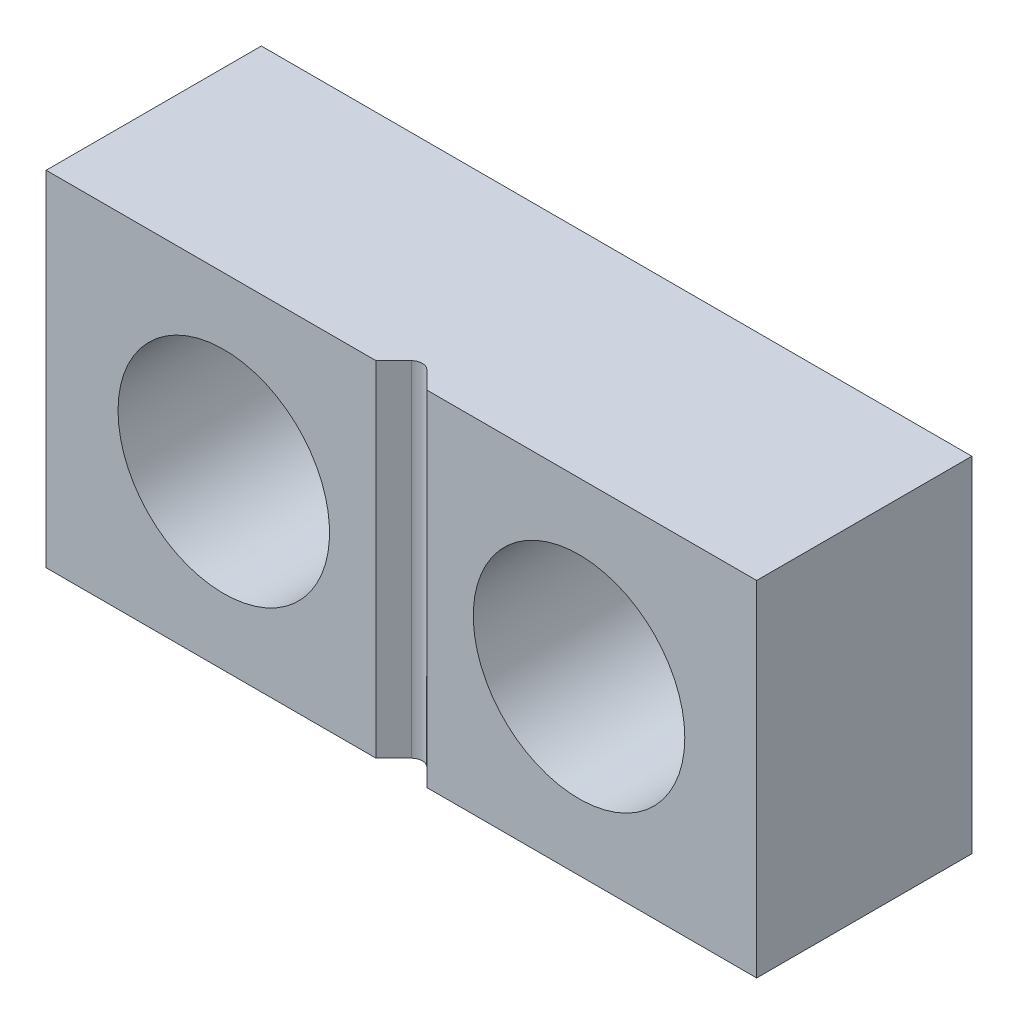
ISO-10303-21;
HEADER;
FILE_DESCRIPTION(('STEP AP214'),'2;1');
FILE_NAME('part.step','',(''),(''),'','','');
FILE_SCHEMA(('AUTOMOTIVE_DESIGN { 1 0 10303 214 1 1 1 1 }'));
ENDSEC;
DATA;
#1=APPLICATION_CONTEXT('core data for automotive mechanical design processes');
#2=APPLICATION_PROTOCOL_DEFINITION('international standard','automotive_design',2000,#1);
#3=PRODUCT_CONTEXT('',#1,'mechanical');
#4=PRODUCT('Part','Part','',(#3));
#5=PRODUCT_RELATED_PRODUCT_CATEGORY('part','',(#4));
#6=PRODUCT_DEFINITION_FORMATION('','',#4);
#7=PRODUCT_DEFINITION_CONTEXT('part definition',#1,'design');
#8=PRODUCT_DEFINITION('design','',#6,#7);
#9=PRODUCT_DEFINITION_SHAPE('','',#8);
#10=(LENGTH_UNIT() NAMED_UNIT(*) SI_UNIT(.MILLI.,.METRE.));
#11=(NAMED_UNIT(*) PLANE_ANGLE_UNIT() SI_UNIT($,.RADIAN.));
#12=(NAMED_UNIT(*) SI_UNIT($,.STERADIAN.) SOLID_ANGLE_UNIT());
#13=UNCERTAINTY_MEASURE_WITH_UNIT(LENGTH_MEASURE(1.E-05),#10,'distance_accuracy_value','');
#14=(GEOMETRIC_REPRESENTATION_CONTEXT(3) GLOBAL_UNCERTAINTY_ASSIGNED_CONTEXT((#13)) GLOBAL_UNIT_ASSIGNED_CONTEXT((#10,
#11,#12)) REPRESENTATION_CONTEXT('',''));
#15=CARTESIAN_POINT('',(0.,0.,0.));
#16=DIRECTION('',(0.,0.,1.));
#17=DIRECTION('',(1.,0.,0.));
#18=AXIS2_PLACEMENT_3D('',#15,#16,#17);
#19=CARTESIAN_POINT('',(8.255,4.,0.));
#20=DIRECTION('',(0.,0.,-0.999999999999999));
#21=DIRECTION('',(-1.,0.,0.));
#22=AXIS2_PLACEMENT_3D('',#19,#20,#21);
#23=PLANE('',#22);
#24=CARTESIAN_POINT('',(-4.12750000000001,0.,0.));
#25=DIRECTION('',(0.,0.,0.999999999999999));
#26=DIRECTION('',(-1.,0.,0.));
#27=AXIS2_PLACEMENT_3D('',#24,#25,#26);
#28=CIRCLE('',#27,2.45745);
#29=CARTESIAN_POINT('',(-6.58495000000001,0.,0.));
#30=VERTEX_POINT('',#29);
#31=EDGE_CURVE('E158',#30,#30,#28,.T.);
#32=ORIENTED_EDGE('',*,*,#31,.F.);
#33=EDGE_LOOP('',(#32));
#34=FACE_BOUND('',#33,.T.);
#35=DIRECTION('',(1.,0.,0.));
#36=VECTOR('',#35,1.);
#37=CARTESIAN_POINT('',(-8.25500000000004,-4.,0.));
#38=LINE('',#37,#36);
#39=CARTESIAN_POINT('',(-8.25500000000004,-4.,0.));
#40=VERTEX_POINT('',#39);
#41=CARTESIAN_POINT('',(-0.590493938389114,-4.,0.));
#42=VERTEX_POINT('',#41);
#43=EDGE_CURVE('E128',#40,#42,#38,.T.);
#44=ORIENTED_EDGE('',*,*,#43,.T.);
#45=DIRECTION('',(0.,1.,0.));
#46=VECTOR('',#45,1.);
#47=CARTESIAN_POINT('',(-0.590493938389114,-4.,0.));
#48=LINE('',#47,#46);
#49=CARTESIAN_POINT('',(-0.590493938389114,3.99999999999999,0.));
#50=VERTEX_POINT('',#49);
#51=EDGE_CURVE('E154',#42,#50,#48,.T.);
#52=ORIENTED_EDGE('',*,*,#51,.T.);
#53=DIRECTION('',(-1.,0.,0.));
#54=VECTOR('',#53,1.);
#55=CARTESIAN_POINT('',(-8.25500000000007,4.,0.));
#56=LINE('',#55,#54);
#57=CARTESIAN_POINT('',(-8.25500000000007,4.,0.));
#58=VERTEX_POINT('',#57);
#59=EDGE_CURVE('E119',#50,#58,#56,.T.);
#60=ORIENTED_EDGE('',*,*,#59,.T.);
#61=DIRECTION('',(0.,-1.,0.));
#62=VECTOR('',#61,1.);
#63=CARTESIAN_POINT('',(-8.25500000000007,4.,0.));
#64=LINE('',#63,#62);
#65=EDGE_CURVE('E118',#58,#40,#64,.T.);
#66=ORIENTED_EDGE('',*,*,#65,.T.);
#67=EDGE_LOOP('',(#44,#52,#60,#66));
#68=FACE_BOUND('',#67,.T.);
#69=ADVANCED_FACE('F34',(#34,#68),#23,.F.);
#70=CARTESIAN_POINT('',(-8.25500000000009,4.00000000000003,-4.99999999999999));
#71=DIRECTION('',(0.,1.,0.));
#72=DIRECTION('',(0.,0.,0.999999999999999));
#73=AXIS2_PLACEMENT_3D('',#70,#71,#72);
#74=PLANE('',#73);
#75=DIRECTION('',(-0.707106781186547,0.,0.707106781186547));
#76=VECTOR('',#75,1.);
#77=CARTESIAN_POINT('',(-0.590493938389114,3.99999999999999,0.));
#78=LINE('',#77,#76);
#79=CARTESIAN_POINT('',(-0.179605122421433,4.,-0.41088881596766));
#80=VERTEX_POINT('',#79);
#81=EDGE_CURVE('E256',#80,#50,#78,.T.);
#82=ORIENTED_EDGE('',*,*,#81,.F.);
#83=CARTESIAN_POINT('',(0.,4.,-0.231283693546277));
#84=DIRECTION('',(0.,1.,0.));
#85=DIRECTION('',(0.,0.,-0.999999999999999));
#86=AXIS2_PLACEMENT_3D('',#83,#84,#85);
#87=CIRCLE('',#86,0.254);
#88=CARTESIAN_POINT('',(0.179605122421378,3.99999999999999,-0.41088881596766));
#89=VERTEX_POINT('',#88);
#90=EDGE_CURVE('E113',#89,#80,#87,.T.);
#91=ORIENTED_EDGE('',*,*,#90,.F.);
#92=DIRECTION('',(-0.707106781186549,0.,-0.707106781186546));
#93=VECTOR('',#92,1.);
#94=CARTESIAN_POINT('',(0.179605122421378,3.99999999999999,-0.41088881596766));
#95=LINE('',#94,#93);
#96=CARTESIAN_POINT('',(0.590493938388989,3.99999999999999,0.));
#97=VERTEX_POINT('',#96);
#98=EDGE_CURVE('E101',#97,#89,#95,.T.);
#99=ORIENTED_EDGE('',*,*,#98,.F.);
#100=CARTESIAN_POINT('',(8.255,4.,0.));
#101=VERTEX_POINT('',#100);
#102=EDGE_CURVE('E110',#101,#97,#56,.T.);
#103=ORIENTED_EDGE('',*,*,#102,.F.);
#104=DIRECTION('',(0.,0.,0.999999999999999));
#105=VECTOR('',#104,1.);
#106=CARTESIAN_POINT('',(8.255,4.00000000000002,-4.99999999999999));
#107=LINE('',#106,#105);
#108=CARTESIAN_POINT('',(8.255,4.00000000000002,-4.99999999999999));
#109=VERTEX_POINT('',#108);
#110=EDGE_CURVE('E11',#109,#101,#107,.T.);
#111=ORIENTED_EDGE('',*,*,#110,.F.);
#112=DIRECTION('',(-1.,0.,0.));
#113=VECTOR('',#112,1.);
#114=CARTESIAN_POINT('',(-8.25500000000009,4.00000000000003,-4.99999999999999));
#115=LINE('',#114,#113);
#116=CARTESIAN_POINT('',(-8.25500000000009,4.00000000000003,-4.99999999999999));
#117=VERTEX_POINT('',#116);
#118=EDGE_CURVE('E132',#109,#117,#115,.T.);
#119=ORIENTED_EDGE('',*,*,#118,.T.);
#120=DIRECTION('',(0.,0.,0.999999999999999));
#121=VECTOR('',#120,1.);
#122=CARTESIAN_POINT('',(-8.25500000000009,4.00000000000003,-4.99999999999999));
#123=LINE('',#122,#121);
#124=EDGE_CURVE('E38',#117,#58,#123,.T.);
#125=ORIENTED_EDGE('',*,*,#124,.T.);
#126=ORIENTED_EDGE('',*,*,#59,.F.);
#127=EDGE_LOOP('',(#82,#91,#99,#103,#111,#119,#125,#126));
#128=FACE_BOUND('',#127,.T.);
#129=ADVANCED_FACE('F36',(#128),#74,.T.);
#130=CARTESIAN_POINT('',(8.255,4.00000000000002,-4.99999999999999));
#131=DIRECTION('',(1.,0.,0.));
#132=DIRECTION('',(0.,0.,-0.999999999999999));
#133=AXIS2_PLACEMENT_3D('',#130,#131,#132);
#134=PLANE('',#133);
#135=DIRECTION('',(0.,1.,0.));
#136=VECTOR('',#135,1.);
#137=CARTESIAN_POINT('',(8.255,4.,0.));
#138=LINE('',#137,#136);
#139=CARTESIAN_POINT('',(8.25499999999994,-4.00000000000002,0.));
#140=VERTEX_POINT('',#139);
#141=EDGE_CURVE('E117',#140,#101,#138,.T.);
#142=ORIENTED_EDGE('',*,*,#141,.F.);
#143=DIRECTION('',(0.,0.,0.999999999999999));
#144=VECTOR('',#143,1.);
#145=CARTESIAN_POINT('',(8.255,-4.,-4.99999999999999));
#146=LINE('',#145,#144);
#147=CARTESIAN_POINT('',(8.255,-4.,-4.99999999999999));
#148=VERTEX_POINT('',#147);
#149=EDGE_CURVE('E43',#148,#140,#146,.T.);
#150=ORIENTED_EDGE('',*,*,#149,.F.);
#151=DIRECTION('',(0.,1.,0.));
#152=VECTOR('',#151,1.);
#153=CARTESIAN_POINT('',(8.255,4.00000000000002,-4.99999999999999));
#154=LINE('',#153,#152);
#155=EDGE_CURVE('E140',#148,#109,#154,.T.);
#156=ORIENTED_EDGE('',*,*,#155,.T.);
#157=ORIENTED_EDGE('',*,*,#110,.T.);
#158=EDGE_LOOP('',(#142,#150,#156,#157));
#159=FACE_BOUND('',#158,.T.);
#160=ADVANCED_FACE('F198',(#159),#134,.T.);
#161=CARTESIAN_POINT('',(-8.25500000000004,-4.,-4.99999999999999));
#162=DIRECTION('',(0.,-1.,0.));
#163=DIRECTION('',(0.,0.,-0.999999999999999));
#164=AXIS2_PLACEMENT_3D('',#161,#162,#163);
#165=PLANE('',#164);
#166=DIRECTION('',(-0.707106781186547,0.,0.707106781186547));
#167=VECTOR('',#166,1.);
#168=CARTESIAN_POINT('',(-0.590493938389114,-4.,0.));
#169=LINE('',#168,#167);
#170=CARTESIAN_POINT('',(-0.179605122421433,-3.99999999999999,-0.41088881596766));
#171=VERTEX_POINT('',#170);
#172=EDGE_CURVE('E107',#171,#42,#169,.T.);
#173=ORIENTED_EDGE('',*,*,#172,.T.);
#174=ORIENTED_EDGE('',*,*,#43,.F.);
#175=DIRECTION('',(0.,0.,0.999999999999999));
#176=VECTOR('',#175,1.);
#177=CARTESIAN_POINT('',(-8.25500000000004,-4.,-4.99999999999999));
#178=LINE('',#177,#176);
#179=CARTESIAN_POINT('',(-8.25500000000004,-4.,-4.99999999999999));
#180=VERTEX_POINT('',#179);
#181=EDGE_CURVE('E144',#180,#40,#178,.T.);
#182=ORIENTED_EDGE('',*,*,#181,.F.);
#183=DIRECTION('',(1.,0.,0.));
#184=VECTOR('',#183,1.);
#185=CARTESIAN_POINT('',(-8.25500000000004,-4.,-4.99999999999999));
#186=LINE('',#185,#184);
#187=EDGE_CURVE('E137',#180,#148,#186,.T.);
#188=ORIENTED_EDGE('',*,*,#187,.T.);
#189=ORIENTED_EDGE('',*,*,#149,.T.);
#190=CARTESIAN_POINT('',(0.590493938389003,-4.,0.));
#191=VERTEX_POINT('',#190);
#192=EDGE_CURVE('E122',#191,#140,#38,.T.);
#193=ORIENTED_EDGE('',*,*,#192,.F.);
#194=DIRECTION('',(-0.707106781186549,0.,-0.707106781186546));
#195=VECTOR('',#194,1.);
#196=CARTESIAN_POINT('',(0.179605122421336,-3.99999999999999,-0.41088881596766));
#197=LINE('',#196,#195);
#198=CARTESIAN_POINT('',(0.179605122421378,-4.,-0.41088881596766));
#199=VERTEX_POINT('',#198);
#200=EDGE_CURVE('E51',#191,#199,#197,.T.);
#201=ORIENTED_EDGE('',*,*,#200,.T.);
#202=CARTESIAN_POINT('',(0.,-4.,-0.231283693546277));
#203=DIRECTION('',(0.,1.,0.));
#204=DIRECTION('',(0.,0.,-0.999999999999999));
#205=AXIS2_PLACEMENT_3D('',#202,#203,#204);
#206=CIRCLE('',#205,0.254);
#207=EDGE_CURVE('E255',#199,#171,#206,.T.);
#208=ORIENTED_EDGE('',*,*,#207,.T.);
#209=EDGE_LOOP('',(#173,#174,#182,#188,#189,#193,#201,#208));
#210=FACE_BOUND('',#209,.T.);
#211=ADVANCED_FACE('F206',(#210),#165,.T.);
#212=CARTESIAN_POINT('',(-8.25500000000009,4.00000000000003,-4.99999999999999));
#213=DIRECTION('',(-1.,0.,0.));
#214=DIRECTION('',(0.,0.,0.999999999999999));
#215=AXIS2_PLACEMENT_3D('',#212,#213,#214);
#216=PLANE('',#215);
#217=ORIENTED_EDGE('',*,*,#65,.F.);
#218=ORIENTED_EDGE('',*,*,#124,.F.);
#219=DIRECTION('',(0.,-1.,0.));
#220=VECTOR('',#219,1.);
#221=CARTESIAN_POINT('',(-8.25500000000009,4.00000000000003,-4.99999999999999));
#222=LINE('',#221,#220);
#223=EDGE_CURVE('E134',#117,#180,#222,.T.);
#224=ORIENTED_EDGE('',*,*,#223,.T.);
#225=ORIENTED_EDGE('',*,*,#181,.T.);
#226=EDGE_LOOP('',(#217,#218,#224,#225));
#227=FACE_BOUND('',#226,.T.);
#228=ADVANCED_FACE('F151',(#227),#216,.T.);
#229=CARTESIAN_POINT('',(8.255,4.00000000000002,-4.99999999999999));
#230=DIRECTION('',(0.,0.,-0.999999999999999));
#231=DIRECTION('',(-1.,0.,0.));
#232=AXIS2_PLACEMENT_3D('',#229,#230,#231);
#233=PLANE('',#232);
#234=CARTESIAN_POINT('',(-4.12750000000001,0.,-5.00000000000001));
#235=DIRECTION('',(0.,0.,0.999999999999999));
#236=DIRECTION('',(-1.,0.,0.));
#237=AXIS2_PLACEMENT_3D('',#234,#235,#236);
#238=CIRCLE('',#237,2.45745);
#239=CARTESIAN_POINT('',(-6.58495000000001,0.,-5.00000000000001));
#240=VERTEX_POINT('',#239);
#241=EDGE_CURVE('E162',#240,#240,#238,.T.);
#242=ORIENTED_EDGE('',*,*,#241,.T.);
#243=EDGE_LOOP('',(#242));
#244=FACE_BOUND('',#243,.T.);
#245=CARTESIAN_POINT('',(4.12750000000001,0.,-4.99999999999999));
#246=DIRECTION('',(0.,0.,0.999999999999999));
#247=DIRECTION('',(1.,0.,0.));
#248=AXIS2_PLACEMENT_3D('',#245,#246,#247);
#249=CIRCLE('',#248,2.45745);
#250=CARTESIAN_POINT('',(6.58495000000001,0.,-4.99999999999999));
#251=VERTEX_POINT('',#250);
#252=EDGE_CURVE('E124',#251,#251,#249,.T.);
#253=ORIENTED_EDGE('',*,*,#252,.T.);
#254=EDGE_LOOP('',(#253));
#255=FACE_BOUND('',#254,.T.);
#256=ORIENTED_EDGE('',*,*,#118,.F.);
#257=ORIENTED_EDGE('',*,*,#155,.F.);
#258=ORIENTED_EDGE('',*,*,#187,.F.);
#259=ORIENTED_EDGE('',*,*,#223,.F.);
#260=EDGE_LOOP('',(#256,#257,#258,#259));
#261=FACE_BOUND('',#260,.T.);
#262=ADVANCED_FACE('F177',(#244,#255,#261),#233,.T.);
#263=CARTESIAN_POINT('',(4.12749999999999,0.,0.));
#264=DIRECTION('',(0.,0.,0.999999999999999));
#265=DIRECTION('',(1.,0.,0.));
#266=AXIS2_PLACEMENT_3D('',#263,#264,#265);
#267=CIRCLE('',#266,2.45745);
#268=CARTESIAN_POINT('',(6.58494999999999,0.,0.));
#269=VERTEX_POINT('',#268);
#270=EDGE_CURVE('E170',#269,#269,#267,.T.);
#271=ORIENTED_EDGE('',*,*,#270,.F.);
#272=EDGE_LOOP('',(#271));
#273=FACE_BOUND('',#272,.T.);
#274=ORIENTED_EDGE('',*,*,#102,.T.);
#275=DIRECTION('',(0.,1.,0.));
#276=VECTOR('',#275,1.);
#277=CARTESIAN_POINT('',(0.590493938389003,-4.,0.));
#278=LINE('',#277,#276);
#279=EDGE_CURVE('E98',#191,#97,#278,.T.);
#280=ORIENTED_EDGE('',*,*,#279,.F.);
#281=ORIENTED_EDGE('',*,*,#192,.T.);
#282=ORIENTED_EDGE('',*,*,#141,.T.);
#283=EDGE_LOOP('',(#274,#280,#281,#282));
#284=FACE_BOUND('',#283,.T.);
#285=ADVANCED_FACE('F115',(#273,#284),#23,.F.);
#286=CARTESIAN_POINT('',(4.12750000000001,0.,-4.99999999999999));
#287=DIRECTION('',(0.,0.,0.999999999999999));
#288=DIRECTION('',(1.,0.,0.));
#289=AXIS2_PLACEMENT_3D('',#286,#287,#288);
#290=CYLINDRICAL_SURFACE('',#289,2.45745);
#291=ORIENTED_EDGE('',*,*,#252,.F.);
#292=EDGE_LOOP('',(#291));
#293=FACE_BOUND('',#292,.T.);
#294=ORIENTED_EDGE('',*,*,#270,.T.);
#295=EDGE_LOOP('',(#294));
#296=FACE_BOUND('',#295,.T.);
#297=ADVANCED_FACE('F180',(#293,#296),#290,.F.);
#298=CARTESIAN_POINT('',(-4.12750000000001,0.,-5.00000000000001));
#299=DIRECTION('',(0.,0.,0.999999999999999));
#300=DIRECTION('',(1.,0.,0.));
#301=AXIS2_PLACEMENT_3D('',#298,#299,#300);
#302=CYLINDRICAL_SURFACE('',#301,2.45745);
#303=ORIENTED_EDGE('',*,*,#241,.F.);
#304=EDGE_LOOP('',(#303));
#305=FACE_BOUND('',#304,.T.);
#306=ORIENTED_EDGE('',*,*,#31,.T.);
#307=EDGE_LOOP('',(#306));
#308=FACE_BOUND('',#307,.T.);
#309=ADVANCED_FACE('F182',(#305,#308),#302,.F.);
#310=CARTESIAN_POINT('',(-0.590493938389114,-4.,0.));
#311=DIRECTION('',(-0.707106781186549,0.,-0.707106781186546));
#312=DIRECTION('',(-0.707106781186547,0.,0.707106781186547));
#313=AXIS2_PLACEMENT_3D('',#310,#311,#312);
#314=PLANE('',#313);
#315=ORIENTED_EDGE('',*,*,#51,.F.);
#316=ORIENTED_EDGE('',*,*,#172,.F.);
#317=DIRECTION('',(0.,1.,0.));
#318=VECTOR('',#317,1.);
#319=CARTESIAN_POINT('',(-0.179605122421433,-3.99999999999999,-0.41088881596766));
#320=LINE('',#319,#318);
#321=EDGE_CURVE('E159',#171,#80,#320,.T.);
#322=ORIENTED_EDGE('',*,*,#321,.T.);
#323=ORIENTED_EDGE('',*,*,#81,.T.);
#324=EDGE_LOOP('',(#315,#316,#322,#323));
#325=FACE_BOUND('',#324,.T.);
#326=ADVANCED_FACE('F188',(#325),#314,.F.);
#327=CARTESIAN_POINT('',(0.,-4.,-0.231283693546277));
#328=DIRECTION('',(0.,1.,0.));
#329=DIRECTION('',(0.,0.,0.999999999999999));
#330=AXIS2_PLACEMENT_3D('',#327,#328,#329);
#331=CYLINDRICAL_SURFACE('',#330,0.254);
#332=ORIENTED_EDGE('',*,*,#321,.F.);
#333=ORIENTED_EDGE('',*,*,#207,.F.);
#334=DIRECTION('',(0.,1.,0.));
#335=VECTOR('',#334,1.);
#336=CARTESIAN_POINT('',(0.179605122421378,-4.,-0.41088881596766));
#337=LINE('',#336,#335);
#338=EDGE_CURVE('E106',#199,#89,#337,.T.);
#339=ORIENTED_EDGE('',*,*,#338,.T.);
#340=ORIENTED_EDGE('',*,*,#90,.T.);
#341=EDGE_LOOP('',(#332,#333,#339,#340));
#342=FACE_BOUND('',#341,.T.);
#343=ADVANCED_FACE('F238',(#342),#331,.F.);
#344=CARTESIAN_POINT('',(0.179605122421336,-3.99999999999999,-0.41088881596766));
#345=DIRECTION('',(0.707106781186548,0.,-0.707106781186547));
#346=DIRECTION('',(-0.707106781186549,0.,-0.707106781186547));
#347=AXIS2_PLACEMENT_3D('',#344,#345,#346);
#348=PLANE('',#347);
#349=ORIENTED_EDGE('',*,*,#338,.F.);
#350=ORIENTED_EDGE('',*,*,#200,.F.);
#351=ORIENTED_EDGE('',*,*,#279,.T.);
#352=ORIENTED_EDGE('',*,*,#98,.T.);
#353=EDGE_LOOP('',(#349,#350,#351,#352));
#354=FACE_BOUND('',#353,.T.);
#355=ADVANCED_FACE('F100',(#354),#348,.F.);
#356=CLOSED_SHELL('',(#69,#129,#160,#211,#228,#262,#285,#297,#309,#326,#343,#355));
#357=MANIFOLD_SOLID_BREP('B2',#356);
#358=ADVANCED_BREP_SHAPE_REPRESENTATION('',(#18,#357),#14);
#359=SHAPE_DEFINITION_REPRESENTATION(#9,#358);
ENDSEC;
END-ISO-10303-21;
